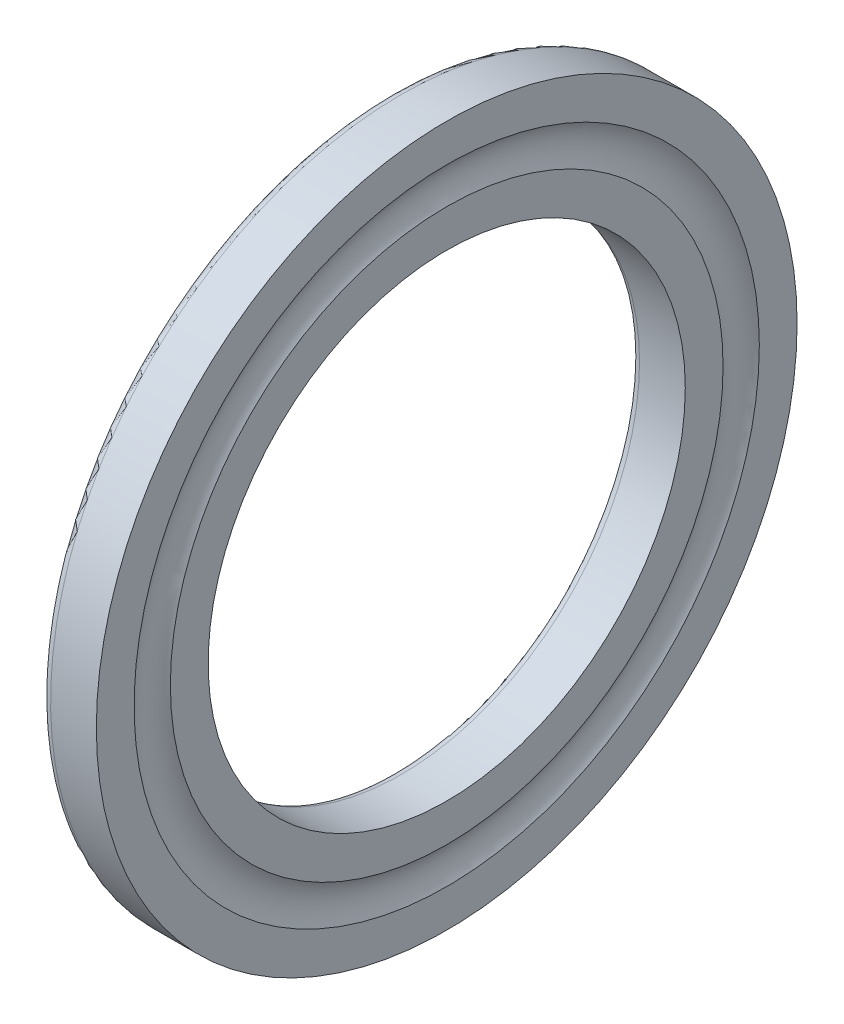
ISO-10303-21;
HEADER;
FILE_DESCRIPTION(('STEP AP214'),'2;1');
FILE_NAME('part.step','',(''),(''),'','','');
FILE_SCHEMA(('AUTOMOTIVE_DESIGN { 1 0 10303 214 1 1 1 1 }'));
ENDSEC;
DATA;
#1=APPLICATION_CONTEXT('core data for automotive mechanical design processes');
#2=APPLICATION_PROTOCOL_DEFINITION('international standard','automotive_design',2000,#1);
#3=PRODUCT_CONTEXT('',#1,'mechanical');
#4=PRODUCT('Part','Part','',(#3));
#5=PRODUCT_RELATED_PRODUCT_CATEGORY('part','',(#4));
#6=PRODUCT_DEFINITION_FORMATION('','',#4);
#7=PRODUCT_DEFINITION_CONTEXT('part definition',#1,'design');
#8=PRODUCT_DEFINITION('design','',#6,#7);
#9=PRODUCT_DEFINITION_SHAPE('','',#8);
#10=(LENGTH_UNIT() NAMED_UNIT(*) SI_UNIT(.MILLI.,.METRE.));
#11=(NAMED_UNIT(*) PLANE_ANGLE_UNIT() SI_UNIT($,.RADIAN.));
#12=(NAMED_UNIT(*) SI_UNIT($,.STERADIAN.) SOLID_ANGLE_UNIT());
#13=UNCERTAINTY_MEASURE_WITH_UNIT(LENGTH_MEASURE(1.E-05),#10,'distance_accuracy_value','');
#14=(GEOMETRIC_REPRESENTATION_CONTEXT(3) GLOBAL_UNCERTAINTY_ASSIGNED_CONTEXT((#13)) GLOBAL_UNIT_ASSIGNED_CONTEXT((#10,
#11,#12)) REPRESENTATION_CONTEXT('',''));
#15=CARTESIAN_POINT('',(0.,0.,0.));
#16=DIRECTION('',(0.,0.,1.));
#17=DIRECTION('',(1.,0.,0.));
#18=AXIS2_PLACEMENT_3D('',#15,#16,#17);
#19=CARTESIAN_POINT('',(5.5,0.,0.));
#20=DIRECTION('',(1.,0.,0.));
#21=DIRECTION('',(0.,1.,0.));
#22=AXIS2_PLACEMENT_3D('',#19,#20,#21);
#23=TOROIDAL_SURFACE('',#22,19.75,2.2);
#24=CARTESIAN_POINT('',(3.66666666666667,0.,0.));
#25=DIRECTION('',(1.,0.,0.));
#26=DIRECTION('',(0.,0.,-1.));
#27=AXIS2_PLACEMENT_3D('',#24,#25,#26);
#28=CIRCLE('',#27,20.9660957564636);
#29=CARTESIAN_POINT('',(3.66666666666667,0.,-20.9660957564636));
#30=VERTEX_POINT('',#29);
#31=EDGE_CURVE('E18',#30,#30,#28,.F.);
#32=ORIENTED_EDGE('',*,*,#31,.F.);
#33=EDGE_LOOP('',(#32));
#34=FACE_BOUND('',#33,.T.);
#35=CARTESIAN_POINT('',(3.66666666666667,0.,0.));
#36=DIRECTION('',(1.,0.,0.));
#37=DIRECTION('',(0.,0.,-1.));
#38=AXIS2_PLACEMENT_3D('',#35,#36,#37);
#39=CIRCLE('',#38,18.5339042435364);
#40=CARTESIAN_POINT('',(3.66666666666667,0.,-18.5339042435364));
#41=VERTEX_POINT('',#40);
#42=EDGE_CURVE('E56',#41,#41,#39,.T.);
#43=ORIENTED_EDGE('',*,*,#42,.F.);
#44=EDGE_LOOP('',(#43));
#45=FACE_BOUND('',#44,.T.);
#46=ADVANCED_FACE('F14',(#34,#45),#23,.F.);
#47=CARTESIAN_POINT('',(3.66666666666667,0.,19.75));
#48=DIRECTION('',(1.,0.,0.));
#49=DIRECTION('',(0.,0.,-1.));
#50=AXIS2_PLACEMENT_3D('',#47,#48,#49);
#51=PLANE('',#50);
#52=CARTESIAN_POINT('',(3.66666666666667,0.,0.));
#53=DIRECTION('',(1.,0.,0.));
#54=DIRECTION('',(0.,0.,-1.));
#55=AXIS2_PLACEMENT_3D('',#52,#53,#54);
#56=CIRCLE('',#55,23.49999999995);
#57=CARTESIAN_POINT('',(3.66666666666667,0.,-23.49999999995));
#58=VERTEX_POINT('',#57);
#59=EDGE_CURVE('E53',#58,#58,#56,.F.);
#60=ORIENTED_EDGE('',*,*,#59,.F.);
#61=EDGE_LOOP('',(#60));
#62=FACE_BOUND('',#61,.T.);
#63=ORIENTED_EDGE('',*,*,#31,.T.);
#64=EDGE_LOOP('',(#63));
#65=FACE_BOUND('',#64,.T.);
#66=ADVANCED_FACE('F63',(#62,#65),#51,.T.);
#67=CARTESIAN_POINT('',(3.66666666666667,0.,19.75));
#68=DIRECTION('',(1.,0.,0.));
#69=DIRECTION('',(0.,0.,-1.));
#70=AXIS2_PLACEMENT_3D('',#67,#68,#69);
#71=PLANE('',#70);
#72=CARTESIAN_POINT('',(3.66666666666667,0.,0.));
#73=DIRECTION('',(1.,0.,0.));
#74=DIRECTION('',(0.,0.,-1.));
#75=AXIS2_PLACEMENT_3D('',#72,#73,#74);
#76=CIRCLE('',#75,16.);
#77=CARTESIAN_POINT('',(3.66666666666667,0.,-16.));
#78=VERTEX_POINT('',#77);
#79=EDGE_CURVE('E40',#78,#78,#76,.T.);
#80=ORIENTED_EDGE('',*,*,#79,.F.);
#81=EDGE_LOOP('',(#80));
#82=FACE_BOUND('',#81,.T.);
#83=ORIENTED_EDGE('',*,*,#42,.T.);
#84=EDGE_LOOP('',(#83));
#85=FACE_BOUND('',#84,.T.);
#86=ADVANCED_FACE('F71',(#82,#85),#71,.T.);
#87=CARTESIAN_POINT('',(2.13333333333333,0.,0.));
#88=DIRECTION('',(1.,0.,0.));
#89=DIRECTION('',(0.,0.,-1.));
#90=AXIS2_PLACEMENT_3D('',#87,#88,#89);
#91=CYLINDRICAL_SURFACE('',#90,23.49999999995);
#92=ORIENTED_EDGE('',*,*,#59,.T.);
#93=EDGE_LOOP('',(#92));
#94=FACE_BOUND('',#93,.T.);
#95=CARTESIAN_POINT('',(0.600000000170712,0.,0.));
#96=DIRECTION('',(1.,0.,0.));
#97=DIRECTION('',(0.,1.,0.));
#98=AXIS2_PLACEMENT_3D('',#95,#96,#97);
#99=CIRCLE('',#98,23.4999999999);
#100=CARTESIAN_POINT('',(0.600000000170712,23.4999999999,0.));
#101=VERTEX_POINT('',#100);
#102=EDGE_CURVE('E35',#101,#101,#99,.F.);
#103=ORIENTED_EDGE('',*,*,#102,.F.);
#104=EDGE_LOOP('',(#103));
#105=FACE_BOUND('',#104,.T.);
#106=ADVANCED_FACE('F117',(#94,#105),#91,.T.);
#107=CARTESIAN_POINT('',(0.6,0.,0.));
#108=DIRECTION('',(1.,0.,0.));
#109=DIRECTION('',(0.,0.,-1.));
#110=AXIS2_PLACEMENT_3D('',#107,#108,#109);
#111=CYLINDRICAL_SURFACE('',#110,16.);
#112=CARTESIAN_POINT('',(0.6,0.,0.));
#113=DIRECTION('',(1.,0.,0.));
#114=DIRECTION('',(0.,1.,0.));
#115=AXIS2_PLACEMENT_3D('',#112,#113,#114);
#116=CIRCLE('',#115,16.);
#117=CARTESIAN_POINT('',(0.6,16.,0.));
#118=VERTEX_POINT('',#117);
#119=EDGE_CURVE('E28',#118,#118,#116,.T.);
#120=ORIENTED_EDGE('',*,*,#119,.F.);
#121=EDGE_LOOP('',(#120));
#122=FACE_BOUND('',#121,.T.);
#123=ORIENTED_EDGE('',*,*,#79,.T.);
#124=EDGE_LOOP('',(#123));
#125=FACE_BOUND('',#124,.T.);
#126=ADVANCED_FACE('F113',(#122,#125),#111,.F.);
#127=CARTESIAN_POINT('',(0.600000000170712,0.,0.));
#128=DIRECTION('',(1.,0.,0.));
#129=DIRECTION('',(0.,1.,0.));
#130=AXIS2_PLACEMENT_3D('',#127,#128,#129);
#131=TOROIDAL_SURFACE('',#130,22.8999999997293,0.600000000170713);
#132=CARTESIAN_POINT('',(0.,0.,0.));
#133=DIRECTION('',(1.,0.,0.));
#134=DIRECTION('',(0.,0.,1.));
#135=AXIS2_PLACEMENT_3D('',#132,#133,#134);
#136=CIRCLE('',#135,22.9);
#137=CARTESIAN_POINT('',(0.,0.,22.9));
#138=VERTEX_POINT('',#137);
#139=EDGE_CURVE('E22',#138,#138,#136,.F.);
#140=ORIENTED_EDGE('',*,*,#139,.F.);
#141=EDGE_LOOP('',(#140));
#142=FACE_BOUND('',#141,.T.);
#143=ORIENTED_EDGE('',*,*,#102,.T.);
#144=EDGE_LOOP('',(#143));
#145=FACE_BOUND('',#144,.T.);
#146=ADVANCED_FACE('F80',(#142,#145),#131,.T.);
#147=CARTESIAN_POINT('',(0.600000000270705,0.,0.));
#148=DIRECTION('',(1.,0.,0.));
#149=DIRECTION('',(0.,1.,0.));
#150=AXIS2_PLACEMENT_3D('',#147,#148,#149);
#151=TOROIDAL_SURFACE('',#150,16.6000000001707,0.600000000170705);
#152=ORIENTED_EDGE('',*,*,#119,.T.);
#153=EDGE_LOOP('',(#152));
#154=FACE_BOUND('',#153,.T.);
#155=CARTESIAN_POINT('',(1.00000086336594E-10,0.,0.));
#156=DIRECTION('',(-1.,0.,0.));
#157=DIRECTION('',(0.,0.,1.));
#158=AXIS2_PLACEMENT_3D('',#155,#156,#157);
#159=CIRCLE('',#158,16.6);
#160=CARTESIAN_POINT('',(1.00000086336594E-10,0.,16.6));
#161=VERTEX_POINT('',#160);
#162=EDGE_CURVE('E10',#161,#161,#159,.F.);
#163=ORIENTED_EDGE('',*,*,#162,.F.);
#164=EDGE_LOOP('',(#163));
#165=FACE_BOUND('',#164,.T.);
#166=ADVANCED_FACE('F75',(#154,#165),#151,.T.);
#167=CARTESIAN_POINT('',(4.99994490255062E-11,0.,19.75));
#168=DIRECTION('',(-1.,0.,-1.58732286574074E-11));
#169=DIRECTION('',(-1.58732286574074E-11,0.,1.));
#170=AXIS2_PLACEMENT_3D('',#167,#168,#169);
#171=PLANE('',#170);
#172=ORIENTED_EDGE('',*,*,#162,.T.);
#173=EDGE_LOOP('',(#172));
#174=FACE_BOUND('',#173,.T.);
#175=ORIENTED_EDGE('',*,*,#139,.T.);
#176=EDGE_LOOP('',(#175));
#177=FACE_BOUND('',#176,.T.);
#178=ADVANCED_FACE('F73',(#174,#177),#171,.T.);
#179=CLOSED_SHELL('',(#46,#66,#86,#106,#126,#146,#166,#178));
#180=MANIFOLD_SOLID_BREP('B1',#179);
#181=ADVANCED_BREP_SHAPE_REPRESENTATION('',(#18,#180),#14);
#182=SHAPE_DEFINITION_REPRESENTATION(#9,#181);
ENDSEC;
END-ISO-10303-21;
